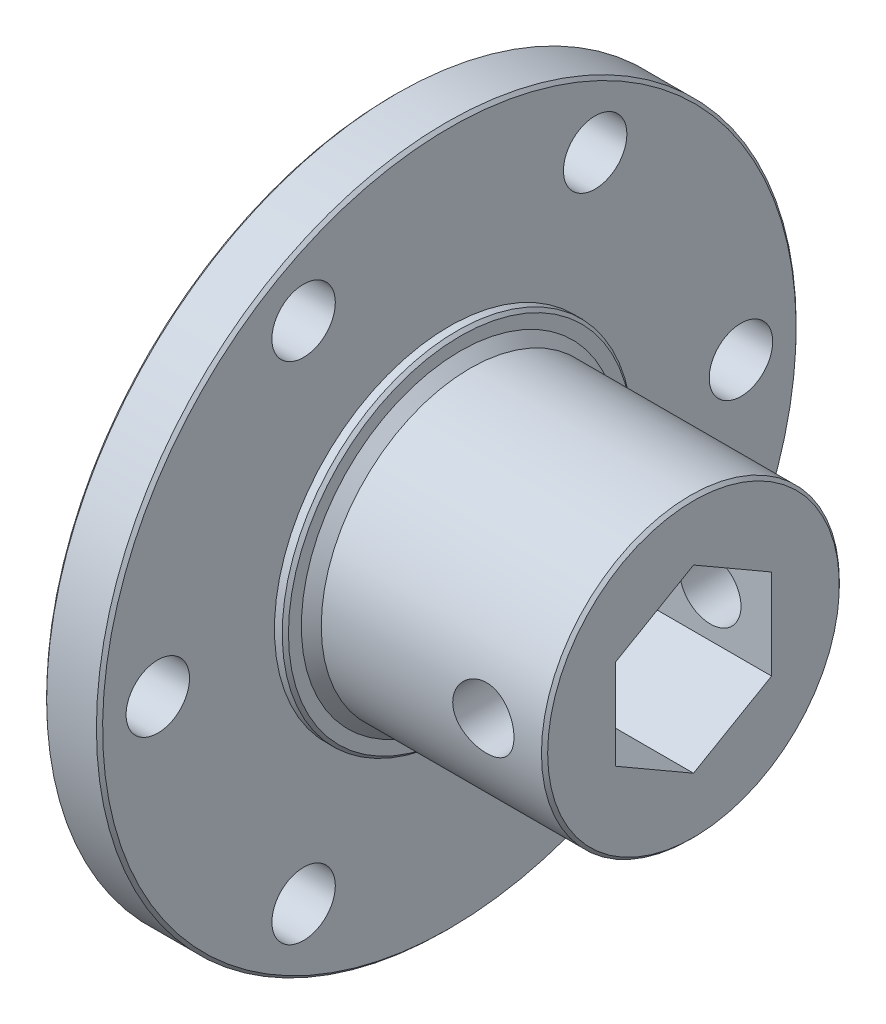
ISO-10303-21;
HEADER;
FILE_DESCRIPTION(('STEP AP214'),'2;1');
FILE_NAME('part.step','',(''),(''),'','','');
FILE_SCHEMA(('AUTOMOTIVE_DESIGN { 1 0 10303 214 1 1 1 1 }'));
ENDSEC;
DATA;
#1=APPLICATION_CONTEXT('core data for automotive mechanical design processes');
#2=APPLICATION_PROTOCOL_DEFINITION('international standard','automotive_design',2000,#1);
#3=PRODUCT_CONTEXT('',#1,'mechanical');
#4=PRODUCT('Part','Part','',(#3));
#5=PRODUCT_RELATED_PRODUCT_CATEGORY('part','',(#4));
#6=PRODUCT_DEFINITION_FORMATION('','',#4);
#7=PRODUCT_DEFINITION_CONTEXT('part definition',#1,'design');
#8=PRODUCT_DEFINITION('design','',#6,#7);
#9=PRODUCT_DEFINITION_SHAPE('','',#8);
#10=(LENGTH_UNIT() NAMED_UNIT(*) SI_UNIT(.MILLI.,.METRE.));
#11=(NAMED_UNIT(*) PLANE_ANGLE_UNIT() SI_UNIT($,.RADIAN.));
#12=(NAMED_UNIT(*) SI_UNIT($,.STERADIAN.) SOLID_ANGLE_UNIT());
#13=UNCERTAINTY_MEASURE_WITH_UNIT(LENGTH_MEASURE(1.E-05),#10,'distance_accuracy_value','');
#14=(GEOMETRIC_REPRESENTATION_CONTEXT(3) GLOBAL_UNCERTAINTY_ASSIGNED_CONTEXT((#13)) GLOBAL_UNIT_ASSIGNED_CONTEXT((#10,
#11,#12)) REPRESENTATION_CONTEXT('',''));
#15=CARTESIAN_POINT('',(0.,0.,0.));
#16=DIRECTION('',(0.,0.,1.));
#17=DIRECTION('',(1.,0.,0.));
#18=AXIS2_PLACEMENT_3D('',#15,#16,#17);
#19=CARTESIAN_POINT('',(6.01493375394323,0.,0.));
#20=DIRECTION('',(-1.,0.,0.));
#21=DIRECTION('',(0.,0.,1.));
#22=AXIS2_PLACEMENT_3D('',#19,#20,#21);
#23=CYLINDRICAL_SURFACE('',#22,12.1666);
#24=CARTESIAN_POINT('',(3.51589759942411,0.,-12.1666));
#25=CARTESIAN_POINT('',(3.51589258907591,-0.138861130624381,-12.1665974318415));
#26=CARTESIAN_POINT('',(3.50428906764594,-0.277784785898916,-12.1641983718655));
#27=CARTESIAN_POINT('',(3.45822163032617,-0.551699815396144,-12.1548595376041));
#28=CARTESIAN_POINT('',(3.42374007146515,-0.686688070799832,-12.1479162589869));
#29=CARTESIAN_POINT('',(3.33303115783503,-0.948732834129887,-12.130263670859));
#30=CARTESIAN_POINT('',(3.27682517122363,-1.07579699401843,-12.1195580629134));
#31=CARTESIAN_POINT('',(3.14432763462228,-1.3186841183282,-12.0955422350655));
#32=CARTESIAN_POINT('',(3.06803708677098,-1.43450764321726,-12.0822321451249));
#33=CARTESIAN_POINT('',(2.89638356008757,-1.65328447570544,-12.0542581646354));
#34=CARTESIAN_POINT('',(2.8007894025931,-1.7560544832001,-12.0395791527408));
#35=CARTESIAN_POINT('',(2.59373900097086,-1.94421920860134,-12.0106307602537));
#36=CARTESIAN_POINT('',(2.48228147134636,-2.02961251701399,-11.9963614129715));
#37=CARTESIAN_POINT('',(2.24533922953231,-2.18138814944662,-11.9696999360322));
#38=CARTESIAN_POINT('',(2.11972958686801,-2.24757915698181,-11.9573272407832));
#39=CARTESIAN_POINT('',(1.85887494704181,-2.35784518981368,-11.936075381113));
#40=CARTESIAN_POINT('',(1.72363095963326,-2.40192252890966,-11.9271958512157));
#41=CARTESIAN_POINT('',(1.449323560617,-2.46611190475769,-11.9140889904362));
#42=CARTESIAN_POINT('',(1.31033865381684,-2.48654639174605,-11.9097991263668));
#43=CARTESIAN_POINT('',(1.03085207265923,-2.50387186811932,-11.9061692121641));
#44=CARTESIAN_POINT('',(0.890350563855775,-2.5007654018199,-11.9068286271106));
#45=CARTESIAN_POINT('',(0.614188918778467,-2.47135751120406,-11.9129660063136));
#46=CARTESIAN_POINT('',(0.478487302196712,-2.44542712014351,-11.9183668880761));
#47=CARTESIAN_POINT('',(0.213402391331127,-2.37169372504108,-11.9332571454554));
#48=CARTESIAN_POINT('',(0.0840194142277943,-2.32388962423805,-11.9427467260808));
#49=CARTESIAN_POINT('',(-0.1658173242309,-2.20741539202245,-11.9648231422042));
#50=CARTESIAN_POINT('',(-0.286201127779297,-2.13859945001439,-11.9774315003471));
#51=CARTESIAN_POINT('',(-0.513851153000887,-1.98215774415424,-12.0043111884542));
#52=CARTESIAN_POINT('',(-0.621115784538627,-1.89452970368375,-12.018582719598));
#53=CARTESIAN_POINT('',(-0.821622231040855,-1.70097105819842,-12.0475137457115));
#54=CARTESIAN_POINT('',(-0.914558609754125,-1.59472410641678,-12.0621754575783));
#55=CARTESIAN_POINT('',(-1.08133981719778,-1.36799154931105,-12.0899867269579));
#56=CARTESIAN_POINT('',(-1.15518437428606,-1.24750574142932,-12.1031362629537));
#57=CARTESIAN_POINT('',(-1.28174760801658,-0.995366842292128,-12.1264767094245));
#58=CARTESIAN_POINT('',(-1.33442992213256,-0.863694996557993,-12.1366625192008));
#59=CARTESIAN_POINT('',(-1.41683976699298,-0.593113254024857,-12.1528893904118));
#60=CARTESIAN_POINT('',(-1.44657023593413,-0.454204286122368,-12.1589309823604));
#61=CARTESIAN_POINT('',(-1.48179667389082,-0.175714772967208,-12.1661143486597));
#62=CARTESIAN_POINT('',(-1.4877104155153,-0.0361891850294911,-12.1673405802725));
#63=CARTESIAN_POINT('',(-1.47626269746412,0.241856330651024,-12.164990242431));
#64=CARTESIAN_POINT('',(-1.45890262235794,0.380376317724577,-12.1614139586804));
#65=CARTESIAN_POINT('',(-1.40174697866081,0.651120441349816,-12.1499134027879));
#66=CARTESIAN_POINT('',(-1.36216712440131,0.783392049392726,-12.1420309552889));
#67=CARTESIAN_POINT('',(-1.26193222369792,1.03942060371598,-12.1227990724969));
#68=CARTESIAN_POINT('',(-1.20127553406873,1.16317688522578,-12.1114493668991));
#69=CARTESIAN_POINT('',(-1.05971449561884,1.40041397489711,-12.0863320785182));
#70=CARTESIAN_POINT('',(-0.978560351797617,1.51374257579288,-12.072535342387));
#71=CARTESIAN_POINT('',(-0.798640952571092,1.72532297455108,-12.0441202427169));
#72=CARTESIAN_POINT('',(-0.699873696390173,1.8235730571955,-12.0295017859633));
#73=CARTESIAN_POINT('',(-0.485625362865226,2.00383109791048,-12.0008041307805));
#74=CARTESIAN_POINT('',(-0.369900395298839,2.08555151780213,-11.9867374334683));
#75=CARTESIAN_POINT('',(-0.126121310591102,2.22839582730587,-11.9610073571958));
#76=CARTESIAN_POINT('',(0.00193229945406504,2.28952056358542,-11.9493438794492));
#77=CARTESIAN_POINT('',(0.26607401852506,2.38905287245756,-11.9298431403749));
#78=CARTESIAN_POINT('',(0.40211494547577,2.42758147991852,-11.9219855333307));
#79=CARTESIAN_POINT('',(0.678919556942183,2.48119169673179,-11.91094479848));
#80=CARTESIAN_POINT('',(0.819682583953287,2.49627655665881,-11.9077610226304));
#81=CARTESIAN_POINT('',(1.09904539094621,2.50244557980573,-11.9064658046602));
#82=CARTESIAN_POINT('',(1.23763488108973,2.49398451321657,-11.908258249333));
#83=CARTESIAN_POINT('',(1.51136945460724,2.45430923857709,-11.9164980187947));
#84=CARTESIAN_POINT('',(1.64651456912172,2.42309523631089,-11.9229453014839));
#85=CARTESIAN_POINT('',(1.90921432715028,2.33900789206199,-11.9397242083983));
#86=CARTESIAN_POINT('',(2.03678848831841,2.28619328517792,-11.9500452929933));
#87=CARTESIAN_POINT('',(2.28133516141157,2.16045738870012,-11.9734143239458));
#88=CARTESIAN_POINT('',(2.39830672063076,2.08753429461616,-11.9864625150023));
#89=CARTESIAN_POINT('',(2.62058594034824,1.92211092491989,-12.0141076651293));
#90=CARTESIAN_POINT('',(2.72564719762951,1.82928343260132,-12.0287281759668));
#91=CARTESIAN_POINT('',(2.91885155210359,1.62735844271043,-12.0577047101259));
#92=CARTESIAN_POINT('',(3.00699075188771,1.51825720730269,-12.0720606718312));
#93=CARTESIAN_POINT('',(3.16478168632801,1.28541733608544,-12.0990798198898));
#94=CARTESIAN_POINT('',(3.23421615440043,1.16152895338604,-12.1117223299374));
#95=CARTESIAN_POINT('',(3.35116928698204,0.903614129661669,-12.1336856148129));
#96=CARTESIAN_POINT('',(3.39870731887216,0.769596770339766,-12.1430093234529));
#97=CARTESIAN_POINT('',(3.46151826995824,0.52943656618017,-12.1555147565455));
#98=CARTESIAN_POINT('',(3.4818734502801,0.424642603348373,-12.1596469972823));
#99=CARTESIAN_POINT('',(3.5090648014055,0.213244676317969,-12.1651905573396));
#100=CARTESIAN_POINT('',(3.51590144720654,0.106640775847459,-12.1666019722611));
#101=CARTESIAN_POINT('',(3.51589759942411,0.,-12.1666));
#102=B_SPLINE_CURVE_WITH_KNOTS('',3,(#24,#25,#26,#27,#28,#29,#30,#31,#32,#33,#34,#35,#36,#37,
#38,#39,#40,#41,#42,#43,#44,#45,#46,#47,#48,#49,#50,#51,#52,#53,#54,#55,#56,#57,#58,#59,#60,#61,
#62,#63,#64,#65,#66,#67,#68,#69,#70,#71,#72,#73,#74,#75,#76,#77,#78,#79,#80,#81,#82,#83,#84,#85,
#86,#87,#88,#89,#90,#91,#92,#93,#94,#95,#96,#97,#98,#99,#100,#101),.UNSPECIFIED.,.T.,.F.,(4,2,2,
2,2,2,2,2,2,2,2,2,2,2,2,2,2,2,2,2,2,2,2,2,2,2,2,2,2,2,2,2,2,2,2,2,2,2,4),(0.,0.416193205487978,
0.832707742416402,1.24881363374668,1.66489876700426,2.08629887807953,2.50773315699882,
2.9332324090432,3.35868713092254,3.77826827437994,4.19780406998616,4.61064316581797,
5.02350296392267,5.4392955305873,5.85513844438159,6.27888881097215,6.70264520643256,
7.1271266483588,7.5515537409776,7.96850259347096,8.38542664259633,8.79837140949158,
9.21134837747644,9.6296238877745,10.0479469427161,10.4730173396616,10.8980702602658,
11.320825108864,11.7435213354837,12.1581104987568,12.5726959124127,12.9861614263389,
13.3996640558078,13.8205720490898,14.2415768679344,14.6672794650429,15.0926048020445,
15.412238710391,15.7318613876377),.UNSPECIFIED.);
#103=CARTESIAN_POINT('',(3.51589759942411,0.,-12.1666));
#104=VERTEX_POINT('',#103);
#105=EDGE_CURVE('E490',#104,#104,#102,.T.);
#106=ORIENTED_EDGE('',*,*,#105,.F.);
#107=EDGE_LOOP('',(#106));
#108=FACE_BOUND('',#107,.T.);
#109=CARTESIAN_POINT('',(3.51493375387173,0.,12.1666));
#110=CARTESIAN_POINT('',(3.51492769338588,0.138861150520796,12.1665974318489));
#111=CARTESIAN_POINT('',(3.5033231180094,0.277784738058015,12.1641983711964));
#112=CARTESIAN_POINT('',(3.45725359582969,0.551699458561862,12.1548595520759));
#113=CARTESIAN_POINT('',(3.42277100599936,0.686687472562073,12.1479162892741));
#114=CARTESIAN_POINT('',(3.33206008299796,0.948731587553405,12.1302637648417));
#115=CARTESIAN_POINT('',(3.27585311799555,1.07579534069097,12.1195582047555));
#116=CARTESIAN_POINT('',(3.1433537004707,1.31868149839335,12.0955425157794));
#117=CARTESIAN_POINT('',(3.06706225010369,1.43450446344513,12.0822325168517));
#118=CARTESIAN_POINT('',(2.89540700645708,1.65328002643173,12.0542587688942));
#119=CARTESIAN_POINT('',(2.79981203611914,1.75604932274631,12.0395798991685));
#120=CARTESIAN_POINT('',(2.59276013145898,1.94421249760625,12.0106318403189));
#121=CARTESIAN_POINT('',(2.48130191169747,2.02960496669944,11.9963626845077));
#122=CARTESIAN_POINT('',(2.24435847532143,2.18137877191967,11.9697016388256));
#123=CARTESIAN_POINT('',(2.11874833472572,2.24756879827434,11.9573291829703));
#124=CARTESIAN_POINT('',(1.85789287696502,2.3578327980544,11.9360778240395));
#125=CARTESIAN_POINT('',(1.72264856954501,2.40190908530995,11.927198555482));
#126=CARTESIAN_POINT('',(1.44834074151375,2.46609633081038,11.9140922111015));
#127=CARTESIAN_POINT('',(1.30935572372407,2.4865297424685,11.9098026016231));
#128=CARTESIAN_POINT('',(1.02986911065215,2.50385307325792,11.9061731638753));
#129=CARTESIAN_POINT('',(0.889367680896558,2.50074553660086,11.906832800711));
#130=CARTESIAN_POINT('',(0.613206296416652,2.47133555393607,11.9129705626639));
#131=CARTESIAN_POINT('',(0.477504859922391,2.445404127975,11.9183716088441));
#132=CARTESIAN_POINT('',(0.212420476699524,2.37166870586615,11.9332621211023));
#133=CARTESIAN_POINT('',(0.0830378471777339,2.32386361289745,11.9427517921965));
#134=CARTESIAN_POINT('',(-0.166798098022306,2.20738742865695,11.9648283060849));
#135=CARTESIAN_POINT('',(-0.287181450212764,2.13857051769238,11.9774366723044));
#136=CARTESIAN_POINT('',(-0.514830418034575,1.98212694414423,12.004316280163));
#137=CARTESIAN_POINT('',(-0.62209444353407,1.89449800498266,12.0185877229671));
#138=CARTESIAN_POINT('',(-0.822599480937977,1.70093767570207,12.0475184654521));
#139=CARTESIAN_POINT('',(-0.915535060061979,1.59468994708828,12.0621799800881));
#140=CARTESIAN_POINT('',(-1.08231454229639,1.36795596982662,12.0899907591193));
#141=CARTESIAN_POINT('',(-1.15615817387628,1.24746951870753,12.1031400020051));
#142=CARTESIAN_POINT('',(-1.28271939577932,0.995329595273091,12.1264797711643));
#143=CARTESIAN_POINT('',(-1.33540064067788,0.863657377669811,12.1366651990252));
#144=CARTESIAN_POINT('',(-1.41780830479762,0.593075087934782,12.152891255805));
#145=CARTESIAN_POINT('',(-1.44753766223962,0.454165944680302,12.1589324152479));
#146=CARTESIAN_POINT('',(-1.48276189080115,0.175676305399468,12.1661149046911));
#147=CARTESIAN_POINT('',(-1.48867453746527,0.036150763464981,12.1673406928687));
#148=CARTESIAN_POINT('',(-1.47722467127664,-0.241894466083706,12.1649894826222));
#149=CARTESIAN_POINT('',(-1.4598635428771,-0.380414213035372,12.1614127698775));
#150=CARTESIAN_POINT('',(-1.40270585805449,-0.651157785251698,12.1499113991709));
#151=CARTESIAN_POINT('',(-1.36312499834134,-0.78342907996697,12.1420285621632));
#152=CARTESIAN_POINT('',(-1.26288815805502,-1.03945684473533,12.1227959612326));
#153=CARTESIAN_POINT('',(-1.2022305342197,-1.16321264997178,12.111445926996));
#154=CARTESIAN_POINT('',(-1.06066766323901,-1.40044871429268,12.0863280488865));
#155=CARTESIAN_POINT('',(-0.979512609670604,-1.51377675659337,12.0725310512169));
#156=CARTESIAN_POINT('',(-0.799591481271239,-1.72535589235489,12.0441155218966));
#157=CARTESIAN_POINT('',(-0.70082340568978,-1.82360527059387,12.0294968970427));
#158=CARTESIAN_POINT('',(-0.486573559232528,-2.00386173402658,12.0007990093178));
#159=CARTESIAN_POINT('',(-0.370847903992064,-2.08558128369372,11.9867322490093));
#160=CARTESIAN_POINT('',(-0.127067586518895,-2.22842374150606,11.9610021510899));
#161=CARTESIAN_POINT('',(0.00098656854726273,-2.28954749645047,11.9493387146736));
#162=CARTESIAN_POINT('',(0.265129100511585,-2.38907771641339,11.9298381606237));
#163=CARTESIAN_POINT('',(0.401170289101467,-2.4276052350791,11.921980693688));
#164=CARTESIAN_POINT('',(0.677975232783762,-2.48121325146452,11.9109403057807));
#165=CARTESIAN_POINT('',(0.818738330392708,-2.49629699978852,11.9077567367516));
#166=CARTESIAN_POINT('',(1.09810104862468,-2.50246383322371,11.9064619679129));
#167=CARTESIAN_POINT('',(1.23669038301077,-2.49400169396019,11.9082546529421));
#168=CARTESIAN_POINT('',(1.51042446532778,-2.45432433280914,11.9164949117967));
#169=CARTESIAN_POINT('',(1.64556924438866,-2.42310931662487,11.9229424435387));
#170=CARTESIAN_POINT('',(1.9082682461325,-2.33902001224301,11.9397218376817));
#171=CARTESIAN_POINT('',(2.03584198281372,-2.28620444659546,11.9500431627017));
#172=CARTESIAN_POINT('',(2.28038765708865,-2.16046672172051,11.9734126449295));
#173=CARTESIAN_POINT('',(2.39735864193727,-2.08754275796209,11.9864610468403));
#174=CARTESIAN_POINT('',(2.61963662268077,-1.92211770500577,12.0141065866516));
#175=CARTESIAN_POINT('',(2.72469720667362,-1.82928939262328,12.0287272761726));
#176=CARTESIAN_POINT('',(2.91790008504187,-1.62736287754496,12.0577041181529));
#177=CARTESIAN_POINT('',(3.00603848199876,-1.5182609370593,12.0720602089846));
#178=CARTESIAN_POINT('',(3.16382767426454,-1.28541980534805,12.0990795636943));
#179=CARTESIAN_POINT('',(3.23326120560341,-1.16153087139879,12.1117221510718));
#180=CARTESIAN_POINT('',(3.35021238086353,-0.903615105579556,12.1336855471829));
#181=CARTESIAN_POINT('',(3.39774939230564,-0.769597355301771,12.1430092897766));
#182=CARTESIAN_POINT('',(3.46055848655901,-0.529436696543488,12.1555147521824));
#183=CARTESIAN_POINT('',(3.48091285256509,-0.424642634371374,12.1596469966097));
#184=CARTESIAN_POINT('',(3.50810257584894,-0.213244613531018,12.1651905588452));
#185=CARTESIAN_POINT('',(3.51493840812214,-0.106640718586912,12.1666019722541));
#186=CARTESIAN_POINT('',(3.51493375387173,0.,12.1666));
#187=B_SPLINE_CURVE_WITH_KNOTS('',3,(#109,#110,#111,#112,#113,#114,#115,#116,#117,#118,#119,
#120,#121,#122,#123,#124,#125,#126,#127,#128,#129,#130,#131,#132,#133,#134,#135,#136,#137,#138,
#139,#140,#141,#142,#143,#144,#145,#146,#147,#148,#149,#150,#151,#152,#153,#154,#155,#156,#157,
#158,#159,#160,#161,#162,#163,#164,#165,#166,#167,#168,#169,#170,#171,#172,#173,#174,#175,#176,
#177,#178,#179,#180,#181,#182,#183,#184,#185,#186),.UNSPECIFIED.,.T.,.F.,(4,2,2,2,2,2,2,2,2,2,2,
2,2,2,2,2,2,2,2,2,2,2,2,2,2,2,2,2,2,2,2,2,2,2,2,2,2,2,4),(0.,0.41619326541321,0.832707863666434,
1.24881381508595,1.66489900800374,2.08629917143874,2.50773350145838,2.93323264051978,
3.35868724897672,3.77826823179519,4.19780386862462,4.61064303703799,5.02350290889636,
5.43929574161291,5.85513892078538,6.27888939704048,6.70264589965082,7.12712710453001,
7.55155395978677,7.96850252729331,8.38542629348757,8.79837109316704,9.21134809555388,
9.62962390664352,10.0479472620582,10.4730178525551,10.8980709640769,11.3208256543743,
11.7435217222394,12.1581106275157,12.5726957846405,12.9861612777353,13.3996638873751,
13.8205720496554,14.2415770370423,14.6672797214795,15.0926051444651,15.4122388813605,
15.7318613872107),.UNSPECIFIED.);
#188=CARTESIAN_POINT('',(3.51493375387173,0.,12.1666));
#189=VERTEX_POINT('',#188);
#190=EDGE_CURVE('E126',#189,#189,#187,.T.);
#191=ORIENTED_EDGE('',*,*,#190,.F.);
#192=EDGE_LOOP('',(#191));
#193=FACE_BOUND('',#192,.T.);
#194=CARTESIAN_POINT('',(5.76093375394327,0.,0.));
#195=DIRECTION('',(-1.,0.,0.));
#196=DIRECTION('',(0.,0.,1.));
#197=AXIS2_PLACEMENT_3D('',#194,#195,#196);
#198=CIRCLE('',#197,12.1666);
#199=CARTESIAN_POINT('',(5.76093375394327,0.,12.1666));
#200=VERTEX_POINT('',#199);
#201=EDGE_CURVE('E124',#200,#200,#198,.F.);
#202=ORIENTED_EDGE('',*,*,#201,.F.);
#203=EDGE_LOOP('',(#202));
#204=FACE_BOUND('',#203,.T.);
#205=CARTESIAN_POINT('',(-12.2222662460567,0.,0.));
#206=DIRECTION('',(-1.,0.,0.));
#207=DIRECTION('',(0.,0.,1.));
#208=AXIS2_PLACEMENT_3D('',#205,#206,#207);
#209=CIRCLE('',#208,12.1666);
#210=CARTESIAN_POINT('',(-12.2222662460567,0.,12.1666));
#211=VERTEX_POINT('',#210);
#212=EDGE_CURVE('E121',#211,#211,#209,.T.);
#213=ORIENTED_EDGE('',*,*,#212,.F.);
#214=EDGE_LOOP('',(#213));
#215=FACE_BOUND('',#214,.T.);
#216=ADVANCED_FACE('F39',(#108,#193,#204,#215),#23,.T.);
#217=CARTESIAN_POINT('',(5.76093375394327,0.,0.));
#218=DIRECTION('',(-1.,0.,0.));
#219=DIRECTION('',(0.,0.,1.));
#220=AXIS2_PLACEMENT_3D('',#217,#218,#219);
#221=CONICAL_SURFACE('',#220,12.1666,0.785398163397465);
#222=ORIENTED_EDGE('',*,*,#201,.T.);
#223=EDGE_LOOP('',(#222));
#224=FACE_BOUND('',#223,.T.);
#225=CARTESIAN_POINT('',(6.01493375394323,0.,0.));
#226=DIRECTION('',(-1.,0.,0.));
#227=DIRECTION('',(0.,0.,1.));
#228=AXIS2_PLACEMENT_3D('',#225,#226,#227);
#229=CIRCLE('',#228,11.9126);
#230=CARTESIAN_POINT('',(6.01493375394323,0.,11.9126));
#231=VERTEX_POINT('',#230);
#232=EDGE_CURVE('E43',#231,#231,#229,.F.);
#233=ORIENTED_EDGE('',*,*,#232,.F.);
#234=EDGE_LOOP('',(#233));
#235=FACE_BOUND('',#234,.T.);
#236=ADVANCED_FACE('F188',(#224,#235),#221,.T.);
#237=CARTESIAN_POINT('',(-13.0350662460568,0.,0.));
#238=DIRECTION('',(-1.,0.,0.));
#239=DIRECTION('',(0.,-1.,0.));
#240=AXIS2_PLACEMENT_3D('',#237,#238,#239);
#241=CONICAL_SURFACE('',#240,12.9794,0.785398163397438);
#242=ORIENTED_EDGE('',*,*,#212,.T.);
#243=EDGE_LOOP('',(#242));
#244=FACE_BOUND('',#243,.T.);
#245=CARTESIAN_POINT('',(-13.0350662460568,0.,0.));
#246=DIRECTION('',(-1.,0.,0.));
#247=DIRECTION('',(0.,-1.,0.));
#248=AXIS2_PLACEMENT_3D('',#245,#246,#247);
#249=CIRCLE('',#248,12.9794);
#250=CARTESIAN_POINT('',(-13.0350662460568,-12.9794,0.));
#251=VERTEX_POINT('',#250);
#252=EDGE_CURVE('E106',#251,#251,#249,.T.);
#253=ORIENTED_EDGE('',*,*,#252,.F.);
#254=EDGE_LOOP('',(#253));
#255=FACE_BOUND('',#254,.T.);
#256=ADVANCED_FACE('F190',(#244,#255),#241,.T.);
#257=CARTESIAN_POINT('',(6.01493375394323,0.,0.));
#258=DIRECTION('',(1.,0.,0.));
#259=DIRECTION('',(0.,0.,-1.));
#260=AXIS2_PLACEMENT_3D('',#257,#258,#259);
#261=PLANE('',#260);
#262=DIRECTION('',(0.,1.,0.));
#263=VECTOR('',#262,1.);
#264=CARTESIAN_POINT('',(6.01493375394323,-3.68085890619153,-6.37539999999999));
#265=LINE('',#264,#263);
#266=CARTESIAN_POINT('',(6.01493375394323,3.68081890619155,-6.37539999999999));
#267=VERTEX_POINT('',#266);
#268=CARTESIAN_POINT('',(6.01493375394323,-3.68085890619153,-6.37539999999999));
#269=VERTEX_POINT('',#268);
#270=EDGE_CURVE('E115',#267,#269,#265,.F.);
#271=ORIENTED_EDGE('',*,*,#270,.T.);
#272=DIRECTION('',(0.,0.500000000000001,-0.866025403784438));
#273=VECTOR('',#272,1.);
#274=CARTESIAN_POINT('',(6.01493375394323,-7.36169781238308,0.));
#275=LINE('',#274,#273);
#276=CARTESIAN_POINT('',(6.01493375394323,-7.36169781238308,0.));
#277=VERTEX_POINT('',#276);
#278=EDGE_CURVE('E91',#269,#277,#275,.F.);
#279=ORIENTED_EDGE('',*,*,#278,.T.);
#280=DIRECTION('',(0.,-0.500000000000001,-0.866025403784438));
#281=VECTOR('',#280,1.);
#282=CARTESIAN_POINT('',(6.01493375394323,-3.68085890619153,6.3754));
#283=LINE('',#282,#281);
#284=CARTESIAN_POINT('',(6.01493375394323,-3.68085890619153,6.3754));
#285=VERTEX_POINT('',#284);
#286=EDGE_CURVE('E97',#277,#285,#283,.F.);
#287=ORIENTED_EDGE('',*,*,#286,.T.);
#288=DIRECTION('',(0.,-1.,0.));
#289=VECTOR('',#288,1.);
#290=CARTESIAN_POINT('',(6.01493375394323,3.68081890619155,6.3754));
#291=LINE('',#290,#289);
#292=CARTESIAN_POINT('',(6.01493375394323,3.68081890619155,6.3754));
#293=VERTEX_POINT('',#292);
#294=EDGE_CURVE('E181',#285,#293,#291,.F.);
#295=ORIENTED_EDGE('',*,*,#294,.T.);
#296=DIRECTION('',(0.,-0.500000000000001,0.866025403784438));
#297=VECTOR('',#296,1.);
#298=CARTESIAN_POINT('',(6.01493375394323,7.3616578123831,0.));
#299=LINE('',#298,#297);
#300=CARTESIAN_POINT('',(6.01493375394323,7.3616578123831,0.));
#301=VERTEX_POINT('',#300);
#302=EDGE_CURVE('E525',#293,#301,#299,.F.);
#303=ORIENTED_EDGE('',*,*,#302,.T.);
#304=DIRECTION('',(0.,0.500000000000001,0.866025403784438));
#305=VECTOR('',#304,1.);
#306=CARTESIAN_POINT('',(6.01493375394323,3.68081890619155,-6.37539999999999));
#307=LINE('',#306,#305);
#308=EDGE_CURVE('E531',#301,#267,#307,.F.);
#309=ORIENTED_EDGE('',*,*,#308,.T.);
#310=EDGE_LOOP('',(#271,#279,#287,#295,#303,#309));
#311=FACE_BOUND('',#310,.T.);
#312=ORIENTED_EDGE('',*,*,#232,.T.);
#313=EDGE_LOOP('',(#312));
#314=FACE_BOUND('',#313,.T.);
#315=ADVANCED_FACE('F112',(#311,#314),#261,.T.);
#316=CARTESIAN_POINT('',(-13.0350662460568,28.575,0.));
#317=DIRECTION('',(1.,0.,0.));
#318=DIRECTION('',(0.,0.,-1.));
#319=AXIS2_PLACEMENT_3D('',#316,#317,#318);
#320=PLANE('',#319);
#321=ORIENTED_EDGE('',*,*,#252,.T.);
#322=EDGE_LOOP('',(#321));
#323=FACE_BOUND('',#322,.T.);
#324=CARTESIAN_POINT('',(-13.0350662460568,0.,0.));
#325=DIRECTION('',(-1.,0.,0.));
#326=DIRECTION('',(0.,-1.,0.));
#327=AXIS2_PLACEMENT_3D('',#324,#325,#326);
#328=CIRCLE('',#327,14.0335);
#329=CARTESIAN_POINT('',(-13.0350662460568,-14.0335,0.));
#330=VERTEX_POINT('',#329);
#331=EDGE_CURVE('E178',#330,#330,#328,.T.);
#332=ORIENTED_EDGE('',*,*,#331,.F.);
#333=EDGE_LOOP('',(#332));
#334=FACE_BOUND('',#333,.T.);
#335=ADVANCED_FACE('F297',(#323,#334),#320,.T.);
#336=CARTESIAN_POINT('',(-19.3850662460568,-3.68085890619153,6.3754));
#337=DIRECTION('',(0.,-0.866025403784438,0.500000000000001));
#338=DIRECTION('',(0.,-0.500000000000001,-0.866025403784438));
#339=AXIS2_PLACEMENT_3D('',#336,#337,#338);
#340=PLANE('',#339);
#341=DIRECTION('',(1.,0.,0.));
#342=VECTOR('',#341,1.);
#343=CARTESIAN_POINT('',(-19.3850662460568,-7.36169781238308,0.));
#344=LINE('',#343,#342);
#345=CARTESIAN_POINT('',(-19.3850662460568,-7.36169781238308,0.));
#346=VERTEX_POINT('',#345);
#347=EDGE_CURVE('E100',#277,#346,#344,.F.);
#348=ORIENTED_EDGE('',*,*,#347,.T.);
#349=DIRECTION('',(0.,-0.500000000000001,-0.866025403784438));
#350=VECTOR('',#349,1.);
#351=CARTESIAN_POINT('',(-19.3850662460568,-3.68085890619153,6.3754));
#352=LINE('',#351,#350);
#353=CARTESIAN_POINT('',(-19.3850662460568,-3.68085890619153,6.3754));
#354=VERTEX_POINT('',#353);
#355=EDGE_CURVE('E180',#354,#346,#352,.T.);
#356=ORIENTED_EDGE('',*,*,#355,.F.);
#357=DIRECTION('',(1.,0.,0.));
#358=VECTOR('',#357,1.);
#359=CARTESIAN_POINT('',(-19.3850662460568,-3.68085890619153,6.3754));
#360=LINE('',#359,#358);
#361=EDGE_CURVE('E102',#354,#285,#360,.T.);
#362=ORIENTED_EDGE('',*,*,#361,.T.);
#363=ORIENTED_EDGE('',*,*,#286,.F.);
#364=EDGE_LOOP('',(#348,#356,#362,#363));
#365=FACE_BOUND('',#364,.T.);
#366=ADVANCED_FACE('F98',(#365),#340,.F.);
#367=CARTESIAN_POINT('',(-19.3850662460568,-7.36169781238308,0.));
#368=DIRECTION('',(0.,-0.866025403784438,-0.500000000000001));
#369=DIRECTION('',(0.,0.500000000000001,-0.866025403784438));
#370=AXIS2_PLACEMENT_3D('',#367,#368,#369);
#371=PLANE('',#370);
#372=DIRECTION('',(1.,0.,0.));
#373=VECTOR('',#372,1.);
#374=CARTESIAN_POINT('',(-19.3850662460568,-3.68085890619153,-6.37539999999999));
#375=LINE('',#374,#373);
#376=CARTESIAN_POINT('',(-19.3850662460568,-3.68085890619153,-6.37539999999999));
#377=VERTEX_POINT('',#376);
#378=EDGE_CURVE('E116',#269,#377,#375,.F.);
#379=ORIENTED_EDGE('',*,*,#378,.T.);
#380=DIRECTION('',(0.,0.500000000000001,-0.866025403784438));
#381=VECTOR('',#380,1.);
#382=CARTESIAN_POINT('',(-19.3850662460568,-7.36169781238308,0.));
#383=LINE('',#382,#381);
#384=EDGE_CURVE('E109',#346,#377,#383,.T.);
#385=ORIENTED_EDGE('',*,*,#384,.F.);
#386=ORIENTED_EDGE('',*,*,#347,.F.);
#387=ORIENTED_EDGE('',*,*,#278,.F.);
#388=EDGE_LOOP('',(#379,#385,#386,#387));
#389=FACE_BOUND('',#388,.T.);
#390=ADVANCED_FACE('F108',(#389),#371,.F.);
#391=CARTESIAN_POINT('',(-19.3850662460568,-3.68085890619153,-6.37539999999999));
#392=DIRECTION('',(0.,0.,-1.));
#393=DIRECTION('',(0.,1.,0.));
#394=AXIS2_PLACEMENT_3D('',#391,#392,#393);
#395=PLANE('',#394);
#396=CARTESIAN_POINT('',(1.01589759942412,0.,-6.37539999999999));
#397=DIRECTION('',(0.,0.,1.));
#398=DIRECTION('',(1.,0.,0.));
#399=AXIS2_PLACEMENT_3D('',#396,#397,#398);
#400=CIRCLE('',#399,2.49999999999999);
#401=CARTESIAN_POINT('',(3.5158975994241,0.,-6.37539999999999));
#402=VERTEX_POINT('',#401);
#403=EDGE_CURVE('E496',#402,#402,#400,.T.);
#404=ORIENTED_EDGE('',*,*,#403,.F.);
#405=EDGE_LOOP('',(#404));
#406=FACE_BOUND('',#405,.T.);
#407=DIRECTION('',(1.,0.,0.));
#408=VECTOR('',#407,1.);
#409=CARTESIAN_POINT('',(-19.3850662460568,3.68081890619155,-6.37539999999999));
#410=LINE('',#409,#408);
#411=CARTESIAN_POINT('',(-19.3850662460568,3.68081890619155,-6.37539999999999));
#412=VERTEX_POINT('',#411);
#413=EDGE_CURVE('E533',#267,#412,#410,.F.);
#414=ORIENTED_EDGE('',*,*,#413,.T.);
#415=DIRECTION('',(0.,1.,0.));
#416=VECTOR('',#415,1.);
#417=CARTESIAN_POINT('',(-19.3850662460568,0.,-6.37539999999999));
#418=LINE('',#417,#416);
#419=EDGE_CURVE('E513',#377,#412,#418,.T.);
#420=ORIENTED_EDGE('',*,*,#419,.F.);
#421=ORIENTED_EDGE('',*,*,#378,.F.);
#422=ORIENTED_EDGE('',*,*,#270,.F.);
#423=EDGE_LOOP('',(#414,#420,#421,#422));
#424=FACE_BOUND('',#423,.T.);
#425=ADVANCED_FACE('F288',(#406,#424),#395,.F.);
#426=CARTESIAN_POINT('',(-19.3850662460568,3.68081890619155,-6.37539999999999));
#427=DIRECTION('',(0.,0.866025403784438,-0.500000000000001));
#428=DIRECTION('',(0.,0.500000000000001,0.866025403784438));
#429=AXIS2_PLACEMENT_3D('',#426,#427,#428);
#430=PLANE('',#429);
#431=DIRECTION('',(1.,0.,0.));
#432=VECTOR('',#431,1.);
#433=CARTESIAN_POINT('',(-19.3850662460568,7.3616578123831,0.));
#434=LINE('',#433,#432);
#435=CARTESIAN_POINT('',(-19.3850662460568,7.3616578123831,0.));
#436=VERTEX_POINT('',#435);
#437=EDGE_CURVE('E528',#301,#436,#434,.F.);
#438=ORIENTED_EDGE('',*,*,#437,.T.);
#439=DIRECTION('',(0.,0.500000000000001,0.866025403784438));
#440=VECTOR('',#439,1.);
#441=CARTESIAN_POINT('',(-19.3850662460568,3.68081890619155,-6.37539999999999));
#442=LINE('',#441,#440);
#443=EDGE_CURVE('E511',#412,#436,#442,.T.);
#444=ORIENTED_EDGE('',*,*,#443,.F.);
#445=ORIENTED_EDGE('',*,*,#413,.F.);
#446=ORIENTED_EDGE('',*,*,#308,.F.);
#447=EDGE_LOOP('',(#438,#444,#445,#446));
#448=FACE_BOUND('',#447,.T.);
#449=ADVANCED_FACE('F284',(#448),#430,.F.);
#450=CARTESIAN_POINT('',(-19.3850662460568,7.3616578123831,0.));
#451=DIRECTION('',(0.,0.866025403784438,0.500000000000001));
#452=DIRECTION('',(0.,-0.500000000000001,0.866025403784438));
#453=AXIS2_PLACEMENT_3D('',#450,#451,#452);
#454=PLANE('',#453);
#455=DIRECTION('',(1.,0.,0.));
#456=VECTOR('',#455,1.);
#457=CARTESIAN_POINT('',(-19.3850662460568,3.68081890619155,6.3754));
#458=LINE('',#457,#456);
#459=CARTESIAN_POINT('',(-19.3850662460568,3.68081890619155,6.3754));
#460=VERTEX_POINT('',#459);
#461=EDGE_CURVE('E523',#293,#460,#458,.F.);
#462=ORIENTED_EDGE('',*,*,#461,.T.);
#463=DIRECTION('',(0.,-0.500000000000001,0.866025403784438));
#464=VECTOR('',#463,1.);
#465=CARTESIAN_POINT('',(-19.3850662460568,7.3616578123831,0.));
#466=LINE('',#465,#464);
#467=EDGE_CURVE('E58',#436,#460,#466,.T.);
#468=ORIENTED_EDGE('',*,*,#467,.F.);
#469=ORIENTED_EDGE('',*,*,#437,.F.);
#470=ORIENTED_EDGE('',*,*,#302,.F.);
#471=EDGE_LOOP('',(#462,#468,#469,#470));
#472=FACE_BOUND('',#471,.T.);
#473=ADVANCED_FACE('F280',(#472),#454,.F.);
#474=CARTESIAN_POINT('',(-19.3850662460568,3.68081890619155,6.3754));
#475=DIRECTION('',(0.,0.,1.));
#476=DIRECTION('',(0.,-1.,0.));
#477=AXIS2_PLACEMENT_3D('',#474,#475,#476);
#478=PLANE('',#477);
#479=CARTESIAN_POINT('',(1.01493375394323,-1.89061915338556E-05,6.3754));
#480=DIRECTION('',(0.,0.,-1.));
#481=DIRECTION('',(0.,1.,0.));
#482=AXIS2_PLACEMENT_3D('',#479,#480,#481);
#483=CIRCLE('',#482,2.49999999999999);
#484=CARTESIAN_POINT('',(1.01493375394323,2.49998109380845,6.3754));
#485=VERTEX_POINT('',#484);
#486=EDGE_CURVE('E495',#485,#485,#483,.T.);
#487=ORIENTED_EDGE('',*,*,#486,.F.);
#488=EDGE_LOOP('',(#487));
#489=FACE_BOUND('',#488,.T.);
#490=ORIENTED_EDGE('',*,*,#361,.F.);
#491=DIRECTION('',(0.,1.,0.));
#492=VECTOR('',#491,1.);
#493=CARTESIAN_POINT('',(-19.3850662460568,0.,6.3754));
#494=LINE('',#493,#492);
#495=EDGE_CURVE('E507',#460,#354,#494,.F.);
#496=ORIENTED_EDGE('',*,*,#495,.F.);
#497=ORIENTED_EDGE('',*,*,#461,.F.);
#498=ORIENTED_EDGE('',*,*,#294,.F.);
#499=EDGE_LOOP('',(#490,#496,#497,#498));
#500=FACE_BOUND('',#499,.T.);
#501=ADVANCED_FACE('F276',(#489,#500),#478,.F.);
#502=CARTESIAN_POINT('',(-13.2890662460568,0.,0.));
#503=DIRECTION('',(-1.,0.,0.));
#504=DIRECTION('',(0.,-1.,0.));
#505=AXIS2_PLACEMENT_3D('',#502,#503,#504);
#506=CONICAL_SURFACE('',#505,14.2875,0.785398163397452);
#507=ORIENTED_EDGE('',*,*,#331,.T.);
#508=EDGE_LOOP('',(#507));
#509=FACE_BOUND('',#508,.T.);
#510=CARTESIAN_POINT('',(-13.2890662460568,0.,0.));
#511=DIRECTION('',(1.,0.,0.));
#512=DIRECTION('',(0.,0.,-1.));
#513=AXIS2_PLACEMENT_3D('',#510,#511,#512);
#514=CIRCLE('',#513,14.2875);
#515=CARTESIAN_POINT('',(-13.2890662460568,0.,-14.2875));
#516=VERTEX_POINT('',#515);
#517=EDGE_CURVE('E509',#516,#516,#514,.F.);
#518=ORIENTED_EDGE('',*,*,#517,.F.);
#519=EDGE_LOOP('',(#518));
#520=FACE_BOUND('',#519,.T.);
#521=ADVANCED_FACE('F273',(#509,#520),#506,.T.);
#522=CARTESIAN_POINT('',(-19.3850662460568,0.,0.));
#523=DIRECTION('',(-1.,0.,0.));
#524=DIRECTION('',(0.,0.,1.));
#525=AXIS2_PLACEMENT_3D('',#522,#523,#524);
#526=PLANE('',#525);
#527=ORIENTED_EDGE('',*,*,#467,.T.);
#528=ORIENTED_EDGE('',*,*,#495,.T.);
#529=ORIENTED_EDGE('',*,*,#355,.T.);
#530=ORIENTED_EDGE('',*,*,#384,.T.);
#531=ORIENTED_EDGE('',*,*,#419,.T.);
#532=ORIENTED_EDGE('',*,*,#443,.T.);
#533=EDGE_LOOP('',(#527,#528,#529,#530,#531,#532));
#534=FACE_BOUND('',#533,.T.);
#535=CARTESIAN_POINT('',(-19.3850662460568,0.,0.));
#536=DIRECTION('',(1.,0.,0.));
#537=DIRECTION('',(0.,0.,-1.));
#538=AXIS2_PLACEMENT_3D('',#535,#536,#537);
#539=CIRCLE('',#538,14.0335);
#540=CARTESIAN_POINT('',(-19.3850662460568,0.,-14.0335));
#541=VERTEX_POINT('',#540);
#542=EDGE_CURVE('E174',#541,#541,#539,.T.);
#543=ORIENTED_EDGE('',*,*,#542,.F.);
#544=EDGE_LOOP('',(#543));
#545=FACE_BOUND('',#544,.T.);
#546=ADVANCED_FACE('F269',(#534,#545),#526,.T.);
#547=CARTESIAN_POINT('',(-14.1780662460568,0.,0.));
#548=DIRECTION('',(-1.,0.,0.));
#549=DIRECTION('',(0.,-1.,0.));
#550=AXIS2_PLACEMENT_3D('',#547,#548,#549);
#551=CONICAL_SURFACE('',#550,28.575,0.785398163397445);
#552=CARTESIAN_POINT('',(-14.1780662460568,0.,0.));
#553=DIRECTION('',(-1.,0.,0.));
#554=DIRECTION('',(0.,0.,1.));
#555=AXIS2_PLACEMENT_3D('',#552,#553,#554);
#556=CIRCLE('',#555,28.575);
#557=CARTESIAN_POINT('',(-14.1780662460568,0.,28.575));
#558=VERTEX_POINT('',#557);
#559=EDGE_CURVE('E177',#558,#558,#556,.T.);
#560=ORIENTED_EDGE('',*,*,#559,.F.);
#561=EDGE_LOOP('',(#560));
#562=FACE_BOUND('',#561,.T.);
#563=CARTESIAN_POINT('',(-13.9240662460568,0.,0.));
#564=DIRECTION('',(-1.,0.,0.));
#565=DIRECTION('',(0.,-1.,0.));
#566=AXIS2_PLACEMENT_3D('',#563,#564,#565);
#567=CIRCLE('',#566,28.321);
#568=CARTESIAN_POINT('',(-13.9240662460568,-28.321,0.));
#569=VERTEX_POINT('',#568);
#570=EDGE_CURVE('E171',#569,#569,#567,.F.);
#571=ORIENTED_EDGE('',*,*,#570,.F.);
#572=EDGE_LOOP('',(#571));
#573=FACE_BOUND('',#572,.T.);
#574=ADVANCED_FACE('F265',(#562,#573),#551,.T.);
#575=CARTESIAN_POINT('',(14.3030238953624,0.,0.));
#576=DIRECTION('',(1.,0.,0.));
#577=DIRECTION('',(0.,0.,-1.));
#578=AXIS2_PLACEMENT_3D('',#575,#576,#577);
#579=CYLINDRICAL_SURFACE('',#578,14.2875);
#580=CARTESIAN_POINT('',(-13.9240662460568,0.,0.));
#581=DIRECTION('',(1.,0.,0.));
#582=DIRECTION('',(0.,0.,-1.));
#583=AXIS2_PLACEMENT_3D('',#580,#581,#582);
#584=CIRCLE('',#583,14.2875);
#585=CARTESIAN_POINT('',(-13.9240662460568,0.,-14.2875));
#586=VERTEX_POINT('',#585);
#587=EDGE_CURVE('E168',#586,#586,#584,.F.);
#588=ORIENTED_EDGE('',*,*,#587,.F.);
#589=EDGE_LOOP('',(#588));
#590=FACE_BOUND('',#589,.T.);
#591=ORIENTED_EDGE('',*,*,#517,.T.);
#592=EDGE_LOOP('',(#591));
#593=FACE_BOUND('',#592,.T.);
#594=ADVANCED_FACE('F261',(#590,#593),#579,.T.);
#595=CARTESIAN_POINT('',(-13.0350662460568,0.,0.));
#596=DIRECTION('',(-1.,0.,0.));
#597=DIRECTION('',(0.,0.,1.));
#598=AXIS2_PLACEMENT_3D('',#595,#596,#597);
#599=CYLINDRICAL_SURFACE('',#598,28.575);
#600=ORIENTED_EDGE('',*,*,#559,.T.);
#601=EDGE_LOOP('',(#600));
#602=FACE_BOUND('',#601,.T.);
#603=CARTESIAN_POINT('',(-18.2420662460568,0.,0.));
#604=DIRECTION('',(1.,0.,0.));
#605=DIRECTION('',(0.,0.,-1.));
#606=AXIS2_PLACEMENT_3D('',#603,#604,#605);
#607=CIRCLE('',#606,28.575);
#608=CARTESIAN_POINT('',(-18.2420662460568,0.,-28.575));
#609=VERTEX_POINT('',#608);
#610=EDGE_CURVE('E167',#609,#609,#607,.F.);
#611=ORIENTED_EDGE('',*,*,#610,.F.);
#612=EDGE_LOOP('',(#611));
#613=FACE_BOUND('',#612,.T.);
#614=ADVANCED_FACE('F257',(#602,#613),#599,.T.);
#615=CARTESIAN_POINT('',(-19.1310662460568,0.,0.));
#616=DIRECTION('',(1.,0.,0.));
#617=DIRECTION('',(0.,0.,-1.));
#618=AXIS2_PLACEMENT_3D('',#615,#616,#617);
#619=CONICAL_SURFACE('',#618,14.2875,0.785398163397452);
#620=CARTESIAN_POINT('',(-19.1310662460568,0.,0.));
#621=DIRECTION('',(1.,0.,0.));
#622=DIRECTION('',(0.,0.,-1.));
#623=AXIS2_PLACEMENT_3D('',#620,#621,#622);
#624=CIRCLE('',#623,14.2875);
#625=CARTESIAN_POINT('',(-19.1310662460568,0.,-14.2875));
#626=VERTEX_POINT('',#625);
#627=EDGE_CURVE('E157',#626,#626,#624,.T.);
#628=ORIENTED_EDGE('',*,*,#627,.F.);
#629=EDGE_LOOP('',(#628));
#630=FACE_BOUND('',#629,.T.);
#631=ORIENTED_EDGE('',*,*,#542,.T.);
#632=EDGE_LOOP('',(#631));
#633=FACE_BOUND('',#632,.T.);
#634=ADVANCED_FACE('F253',(#630,#633),#619,.T.);
#635=CARTESIAN_POINT('',(-13.9240662460568,0.,5.72637987752451));
#636=DIRECTION('',(1.,0.,0.));
#637=DIRECTION('',(0.,0.,-1.));
#638=AXIS2_PLACEMENT_3D('',#635,#636,#637);
#639=PLANE('',#638);
#640=CARTESIAN_POINT('',(-13.9240662460568,0.,23.8125));
#641=DIRECTION('',(1.,0.,0.));
#642=DIRECTION('',(0.,0.,-1.));
#643=AXIS2_PLACEMENT_3D('',#640,#641,#642);
#644=CIRCLE('',#643,2.59080000000001);
#645=CARTESIAN_POINT('',(-13.9240662460568,0.,21.2217));
#646=VERTEX_POINT('',#645);
#647=EDGE_CURVE('E148',#646,#646,#644,.F.);
#648=ORIENTED_EDGE('',*,*,#647,.T.);
#649=EDGE_LOOP('',(#648));
#650=FACE_BOUND('',#649,.T.);
#651=CARTESIAN_POINT('',(-13.9240662460568,20.622229927617,-11.90625));
#652=DIRECTION('',(1.,0.,0.));
#653=DIRECTION('',(0.,0.,-1.));
#654=AXIS2_PLACEMENT_3D('',#651,#652,#653);
#655=CIRCLE('',#654,2.59080000000001);
#656=CARTESIAN_POINT('',(-13.9240662460568,20.622229927617,-14.49705));
#657=VERTEX_POINT('',#656);
#658=EDGE_CURVE('E151',#657,#657,#655,.F.);
#659=ORIENTED_EDGE('',*,*,#658,.T.);
#660=EDGE_LOOP('',(#659));
#661=FACE_BOUND('',#660,.T.);
#662=CARTESIAN_POINT('',(-13.9240662460568,-20.6222299276169,-11.90625));
#663=DIRECTION('',(1.,0.,0.));
#664=DIRECTION('',(0.,0.,-1.));
#665=AXIS2_PLACEMENT_3D('',#662,#663,#664);
#666=CIRCLE('',#665,2.59080000000001);
#667=CARTESIAN_POINT('',(-13.9240662460568,-20.6222299276169,-14.4970500000001));
#668=VERTEX_POINT('',#667);
#669=EDGE_CURVE('E154',#668,#668,#666,.F.);
#670=ORIENTED_EDGE('',*,*,#669,.T.);
#671=EDGE_LOOP('',(#670));
#672=FACE_BOUND('',#671,.T.);
#673=ORIENTED_EDGE('',*,*,#587,.T.);
#674=EDGE_LOOP('',(#673));
#675=FACE_BOUND('',#674,.T.);
#676=CARTESIAN_POINT('',(-13.9240662460568,-20.622229927617,11.9062499999999));
#677=DIRECTION('',(1.,0.,0.));
#678=DIRECTION('',(0.,0.,-1.));
#679=AXIS2_PLACEMENT_3D('',#676,#677,#678);
#680=CIRCLE('',#679,2.59080000000001);
#681=CARTESIAN_POINT('',(-13.9240662460568,-20.622229927617,9.31544999999993));
#682=VERTEX_POINT('',#681);
#683=EDGE_CURVE('E158',#682,#682,#680,.F.);
#684=ORIENTED_EDGE('',*,*,#683,.T.);
#685=EDGE_LOOP('',(#684));
#686=FACE_BOUND('',#685,.T.);
#687=CARTESIAN_POINT('',(-13.9240662460568,0.,-23.8125));
#688=DIRECTION('',(1.,0.,0.));
#689=DIRECTION('',(0.,0.,-1.));
#690=AXIS2_PLACEMENT_3D('',#687,#688,#689);
#691=CIRCLE('',#690,2.59080000000001);
#692=CARTESIAN_POINT('',(-13.9240662460568,0.,-26.4033));
#693=VERTEX_POINT('',#692);
#694=EDGE_CURVE('E161',#693,#693,#691,.F.);
#695=ORIENTED_EDGE('',*,*,#694,.T.);
#696=EDGE_LOOP('',(#695));
#697=FACE_BOUND('',#696,.T.);
#698=CARTESIAN_POINT('',(-13.9240662460568,20.6222299276169,11.90625));
#699=DIRECTION('',(1.,0.,0.));
#700=DIRECTION('',(0.,0.,-1.));
#701=AXIS2_PLACEMENT_3D('',#698,#699,#700);
#702=CIRCLE('',#701,2.59080000000001);
#703=CARTESIAN_POINT('',(-13.9240662460568,20.6222299276169,9.31544999999999));
#704=VERTEX_POINT('',#703);
#705=EDGE_CURVE('E164',#704,#704,#702,.F.);
#706=ORIENTED_EDGE('',*,*,#705,.T.);
#707=EDGE_LOOP('',(#706));
#708=FACE_BOUND('',#707,.T.);
#709=ORIENTED_EDGE('',*,*,#570,.T.);
#710=EDGE_LOOP('',(#709));
#711=FACE_BOUND('',#710,.T.);
#712=ADVANCED_FACE('F249',(#650,#661,#672,#675,#686,#697,#708,#711),#639,.T.);
#713=CARTESIAN_POINT('',(-18.2420662460568,0.,0.));
#714=DIRECTION('',(1.,0.,0.));
#715=DIRECTION('',(0.,0.,-1.));
#716=AXIS2_PLACEMENT_3D('',#713,#714,#715);
#717=CONICAL_SURFACE('',#716,28.575,0.785398163397448);
#718=CARTESIAN_POINT('',(-18.4960662460568,0.,0.));
#719=DIRECTION('',(1.,0.,0.));
#720=DIRECTION('',(0.,0.,-1.));
#721=AXIS2_PLACEMENT_3D('',#718,#719,#720);
#722=CIRCLE('',#721,28.321);
#723=CARTESIAN_POINT('',(-18.4960662460568,0.,-28.321));
#724=VERTEX_POINT('',#723);
#725=EDGE_CURVE('E145',#724,#724,#722,.T.);
#726=ORIENTED_EDGE('',*,*,#725,.T.);
#727=EDGE_LOOP('',(#726));
#728=FACE_BOUND('',#727,.T.);
#729=ORIENTED_EDGE('',*,*,#610,.T.);
#730=EDGE_LOOP('',(#729));
#731=FACE_BOUND('',#730,.T.);
#732=ADVANCED_FACE('F245',(#728,#731),#717,.T.);
#733=CARTESIAN_POINT('',(-13.0350662460568,20.6222299276169,11.90625));
#734=DIRECTION('',(1.,0.,0.));
#735=DIRECTION('',(0.,0.,-1.));
#736=AXIS2_PLACEMENT_3D('',#733,#734,#735);
#737=CYLINDRICAL_SURFACE('',#736,2.59080000000001);
#738=ORIENTED_EDGE('',*,*,#705,.F.);
#739=EDGE_LOOP('',(#738));
#740=FACE_BOUND('',#739,.T.);
#741=CARTESIAN_POINT('',(-18.4960662460568,20.6222299276169,11.90625));
#742=DIRECTION('',(1.,0.,0.));
#743=DIRECTION('',(0.,0.,-1.));
#744=AXIS2_PLACEMENT_3D('',#741,#742,#743);
#745=CIRCLE('',#744,2.59080000000001);
#746=CARTESIAN_POINT('',(-18.4960662460568,20.6222299276169,9.31544999999999));
#747=VERTEX_POINT('',#746);
#748=EDGE_CURVE('E142',#747,#747,#745,.F.);
#749=ORIENTED_EDGE('',*,*,#748,.T.);
#750=EDGE_LOOP('',(#749));
#751=FACE_BOUND('',#750,.T.);
#752=ADVANCED_FACE('F241',(#740,#751),#737,.F.);
#753=CARTESIAN_POINT('',(-13.0350662460568,0.,-23.8125));
#754=DIRECTION('',(1.,0.,0.));
#755=DIRECTION('',(0.,0.,-1.));
#756=AXIS2_PLACEMENT_3D('',#753,#754,#755);
#757=CYLINDRICAL_SURFACE('',#756,2.59080000000001);
#758=ORIENTED_EDGE('',*,*,#694,.F.);
#759=EDGE_LOOP('',(#758));
#760=FACE_BOUND('',#759,.T.);
#761=CARTESIAN_POINT('',(-18.4960662460568,0.,-23.8125));
#762=DIRECTION('',(1.,0.,0.));
#763=DIRECTION('',(0.,0.,-1.));
#764=AXIS2_PLACEMENT_3D('',#761,#762,#763);
#765=CIRCLE('',#764,2.59080000000001);
#766=CARTESIAN_POINT('',(-18.4960662460568,0.,-26.4033));
#767=VERTEX_POINT('',#766);
#768=EDGE_CURVE('E139',#767,#767,#765,.F.);
#769=ORIENTED_EDGE('',*,*,#768,.T.);
#770=EDGE_LOOP('',(#769));
#771=FACE_BOUND('',#770,.T.);
#772=ADVANCED_FACE('F237',(#760,#771),#757,.F.);
#773=CARTESIAN_POINT('',(-13.0350662460568,-20.622229927617,11.9062499999999));
#774=DIRECTION('',(1.,0.,0.));
#775=DIRECTION('',(0.,0.,-1.));
#776=AXIS2_PLACEMENT_3D('',#773,#774,#775);
#777=CYLINDRICAL_SURFACE('',#776,2.59080000000001);
#778=ORIENTED_EDGE('',*,*,#683,.F.);
#779=EDGE_LOOP('',(#778));
#780=FACE_BOUND('',#779,.T.);
#781=CARTESIAN_POINT('',(-18.4960662460568,-20.622229927617,11.9062499999999));
#782=DIRECTION('',(1.,0.,0.));
#783=DIRECTION('',(0.,0.,-1.));
#784=AXIS2_PLACEMENT_3D('',#781,#782,#783);
#785=CIRCLE('',#784,2.59080000000001);
#786=CARTESIAN_POINT('',(-18.4960662460568,-20.622229927617,9.31544999999993));
#787=VERTEX_POINT('',#786);
#788=EDGE_CURVE('E136',#787,#787,#785,.F.);
#789=ORIENTED_EDGE('',*,*,#788,.T.);
#790=EDGE_LOOP('',(#789));
#791=FACE_BOUND('',#790,.T.);
#792=ADVANCED_FACE('F233',(#780,#791),#777,.F.);
#793=CARTESIAN_POINT('',(14.3030238953624,0.,0.));
#794=DIRECTION('',(1.,0.,0.));
#795=DIRECTION('',(0.,0.,-1.));
#796=AXIS2_PLACEMENT_3D('',#793,#794,#795);
#797=CYLINDRICAL_SURFACE('',#796,14.2875);
#798=CARTESIAN_POINT('',(-18.4960662460568,0.,0.));
#799=DIRECTION('',(1.,0.,0.));
#800=DIRECTION('',(0.,0.,-1.));
#801=AXIS2_PLACEMENT_3D('',#798,#799,#800);
#802=CIRCLE('',#801,14.2875);
#803=CARTESIAN_POINT('',(-18.4960662460568,0.,-14.2875));
#804=VERTEX_POINT('',#803);
#805=EDGE_CURVE('E133',#804,#804,#802,.F.);
#806=ORIENTED_EDGE('',*,*,#805,.T.);
#807=EDGE_LOOP('',(#806));
#808=FACE_BOUND('',#807,.T.);
#809=ORIENTED_EDGE('',*,*,#627,.T.);
#810=EDGE_LOOP('',(#809));
#811=FACE_BOUND('',#810,.T.);
#812=ADVANCED_FACE('F229',(#808,#811),#797,.T.);
#813=CARTESIAN_POINT('',(-13.0350662460568,-20.6222299276169,-11.90625));
#814=DIRECTION('',(1.,0.,0.));
#815=DIRECTION('',(0.,0.,-1.));
#816=AXIS2_PLACEMENT_3D('',#813,#814,#815);
#817=CYLINDRICAL_SURFACE('',#816,2.59080000000001);
#818=ORIENTED_EDGE('',*,*,#669,.F.);
#819=EDGE_LOOP('',(#818));
#820=FACE_BOUND('',#819,.T.);
#821=CARTESIAN_POINT('',(-18.4960662460568,-20.6222299276169,-11.90625));
#822=DIRECTION('',(1.,0.,0.));
#823=DIRECTION('',(0.,0.,-1.));
#824=AXIS2_PLACEMENT_3D('',#821,#822,#823);
#825=CIRCLE('',#824,2.59080000000001);
#826=CARTESIAN_POINT('',(-18.4960662460568,-20.6222299276169,-14.4970500000001));
#827=VERTEX_POINT('',#826);
#828=EDGE_CURVE('E130',#827,#827,#825,.F.);
#829=ORIENTED_EDGE('',*,*,#828,.T.);
#830=EDGE_LOOP('',(#829));
#831=FACE_BOUND('',#830,.T.);
#832=ADVANCED_FACE('F225',(#820,#831),#817,.F.);
#833=CARTESIAN_POINT('',(-13.0350662460568,20.622229927617,-11.90625));
#834=DIRECTION('',(1.,0.,0.));
#835=DIRECTION('',(0.,0.,-1.));
#836=AXIS2_PLACEMENT_3D('',#833,#834,#835);
#837=CYLINDRICAL_SURFACE('',#836,2.59080000000001);
#838=ORIENTED_EDGE('',*,*,#658,.F.);
#839=EDGE_LOOP('',(#838));
#840=FACE_BOUND('',#839,.T.);
#841=CARTESIAN_POINT('',(-18.4960662460568,20.622229927617,-11.90625));
#842=DIRECTION('',(1.,0.,0.));
#843=DIRECTION('',(0.,0.,-1.));
#844=AXIS2_PLACEMENT_3D('',#841,#842,#843);
#845=CIRCLE('',#844,2.59080000000001);
#846=CARTESIAN_POINT('',(-18.4960662460568,20.622229927617,-14.49705));
#847=VERTEX_POINT('',#846);
#848=EDGE_CURVE('E49',#847,#847,#845,.F.);
#849=ORIENTED_EDGE('',*,*,#848,.T.);
#850=EDGE_LOOP('',(#849));
#851=FACE_BOUND('',#850,.T.);
#852=ADVANCED_FACE('F215',(#840,#851),#837,.F.);
#853=CARTESIAN_POINT('',(-13.0350662460568,0.,23.8125));
#854=DIRECTION('',(1.,0.,0.));
#855=DIRECTION('',(0.,0.,-1.));
#856=AXIS2_PLACEMENT_3D('',#853,#854,#855);
#857=CYLINDRICAL_SURFACE('',#856,2.59080000000001);
#858=ORIENTED_EDGE('',*,*,#647,.F.);
#859=EDGE_LOOP('',(#858));
#860=FACE_BOUND('',#859,.T.);
#861=CARTESIAN_POINT('',(-18.4960662460568,0.,23.8125));
#862=DIRECTION('',(1.,0.,0.));
#863=DIRECTION('',(0.,0.,-1.));
#864=AXIS2_PLACEMENT_3D('',#861,#862,#863);
#865=CIRCLE('',#864,2.59080000000001);
#866=CARTESIAN_POINT('',(-18.4960662460568,0.,21.2217));
#867=VERTEX_POINT('',#866);
#868=EDGE_CURVE('E11',#867,#867,#865,.F.);
#869=ORIENTED_EDGE('',*,*,#868,.T.);
#870=EDGE_LOOP('',(#869));
#871=FACE_BOUND('',#870,.T.);
#872=ADVANCED_FACE('F203',(#860,#871),#857,.F.);
#873=CARTESIAN_POINT('',(-18.4960662460568,0.,14.2875));
#874=DIRECTION('',(1.,0.,0.));
#875=DIRECTION('',(0.,0.,-1.));
#876=AXIS2_PLACEMENT_3D('',#873,#874,#875);
#877=PLANE('',#876);
#878=ORIENTED_EDGE('',*,*,#868,.F.);
#879=EDGE_LOOP('',(#878));
#880=FACE_BOUND('',#879,.T.);
#881=ORIENTED_EDGE('',*,*,#848,.F.);
#882=EDGE_LOOP('',(#881));
#883=FACE_BOUND('',#882,.T.);
#884=ORIENTED_EDGE('',*,*,#828,.F.);
#885=EDGE_LOOP('',(#884));
#886=FACE_BOUND('',#885,.T.);
#887=ORIENTED_EDGE('',*,*,#805,.F.);
#888=EDGE_LOOP('',(#887));
#889=FACE_BOUND('',#888,.T.);
#890=ORIENTED_EDGE('',*,*,#788,.F.);
#891=EDGE_LOOP('',(#890));
#892=FACE_BOUND('',#891,.T.);
#893=ORIENTED_EDGE('',*,*,#768,.F.);
#894=EDGE_LOOP('',(#893));
#895=FACE_BOUND('',#894,.T.);
#896=ORIENTED_EDGE('',*,*,#748,.F.);
#897=EDGE_LOOP('',(#896));
#898=FACE_BOUND('',#897,.T.);
#899=ORIENTED_EDGE('',*,*,#725,.F.);
#900=EDGE_LOOP('',(#899));
#901=FACE_BOUND('',#900,.T.);
#902=ADVANCED_FACE('F201',(#880,#883,#886,#889,#892,#895,#898,#901),#877,.F.);
#903=CARTESIAN_POINT('',(1.01493375394323,-1.89061915338556E-05,6.3754));
#904=DIRECTION('',(0.,0.,-1.));
#905=DIRECTION('',(0.,1.,0.));
#906=AXIS2_PLACEMENT_3D('',#903,#904,#905);
#907=CYLINDRICAL_SURFACE('',#906,2.49999999999999);
#908=ORIENTED_EDGE('',*,*,#190,.T.);
#909=EDGE_LOOP('',(#908));
#910=FACE_BOUND('',#909,.T.);
#911=ORIENTED_EDGE('',*,*,#486,.T.);
#912=EDGE_LOOP('',(#911));
#913=FACE_BOUND('',#912,.T.);
#914=ADVANCED_FACE('F200',(#910,#913),#907,.F.);
#915=CARTESIAN_POINT('',(1.01589759942412,0.,-6.37539999999999));
#916=DIRECTION('',(0.,0.,1.));
#917=DIRECTION('',(1.,0.,0.));
#918=AXIS2_PLACEMENT_3D('',#915,#916,#917);
#919=CYLINDRICAL_SURFACE('',#918,2.49999999999999);
#920=ORIENTED_EDGE('',*,*,#105,.T.);
#921=EDGE_LOOP('',(#920));
#922=FACE_BOUND('',#921,.T.);
#923=ORIENTED_EDGE('',*,*,#403,.T.);
#924=EDGE_LOOP('',(#923));
#925=FACE_BOUND('',#924,.T.);
#926=ADVANCED_FACE('F212',(#922,#925),#919,.F.);
#927=CLOSED_SHELL('',(#216,#236,#256,#315,#335,#366,#390,#425,#449,#473,#501,#521,#546,#574,
#594,#614,#634,#712,#732,#752,#772,#792,#812,#832,#852,#872,#902,#914,#926));
#928=MANIFOLD_SOLID_BREP('B2',#927);
#929=ADVANCED_BREP_SHAPE_REPRESENTATION('',(#18,#928),#14);
#930=SHAPE_DEFINITION_REPRESENTATION(#9,#929);
ENDSEC;
END-ISO-10303-21;
